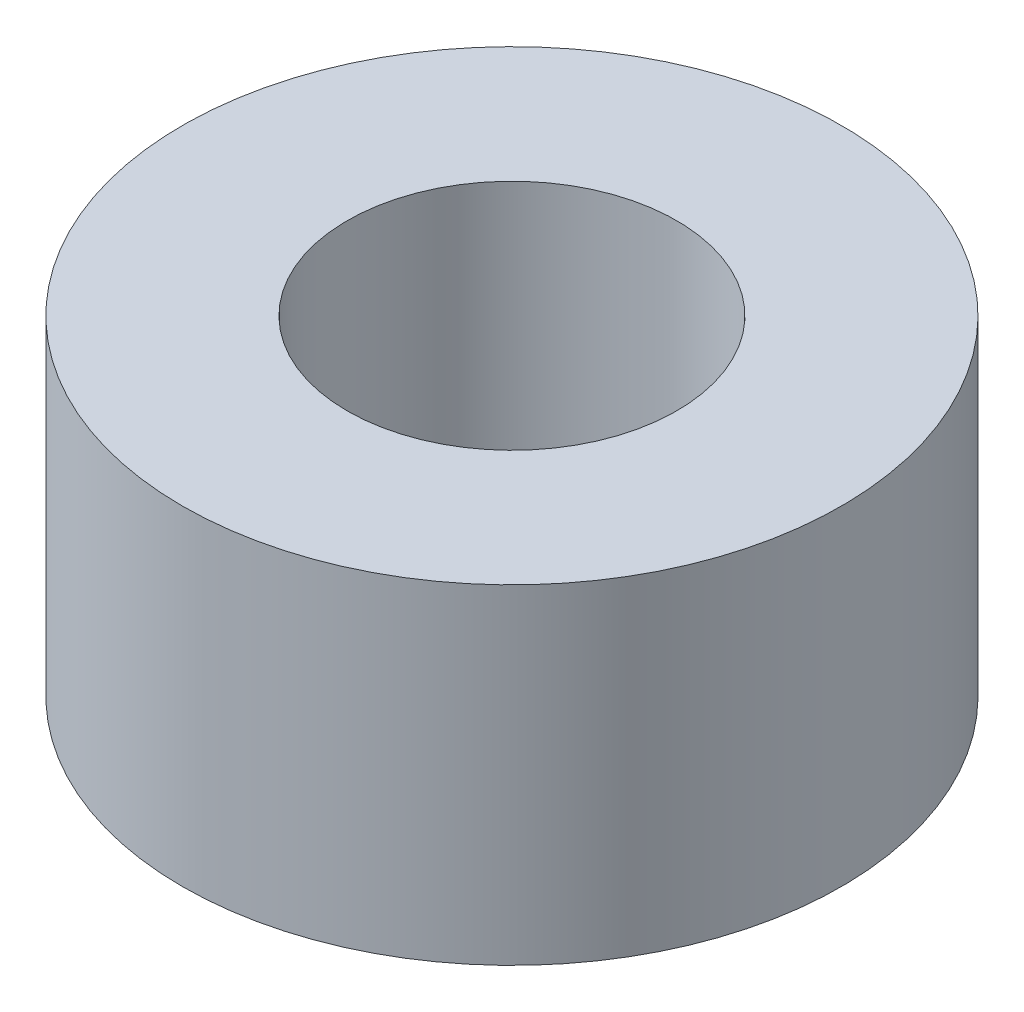
ISO-10303-21;
HEADER;
FILE_DESCRIPTION(('STEP AP214'),'2;1');
FILE_NAME('part.step','',(''),(''),'','','');
FILE_SCHEMA(('AUTOMOTIVE_DESIGN { 1 0 10303 214 1 1 1 1 }'));
ENDSEC;
DATA;
#1=APPLICATION_CONTEXT('core data for automotive mechanical design processes');
#2=APPLICATION_PROTOCOL_DEFINITION('international standard','automotive_design',2000,#1);
#3=PRODUCT_CONTEXT('',#1,'mechanical');
#4=PRODUCT('Part','Part','',(#3));
#5=PRODUCT_RELATED_PRODUCT_CATEGORY('part','',(#4));
#6=PRODUCT_DEFINITION_FORMATION('','',#4);
#7=PRODUCT_DEFINITION_CONTEXT('part definition',#1,'design');
#8=PRODUCT_DEFINITION('design','',#6,#7);
#9=PRODUCT_DEFINITION_SHAPE('','',#8);
#10=(LENGTH_UNIT() NAMED_UNIT(*) SI_UNIT(.MILLI.,.METRE.));
#11=(NAMED_UNIT(*) PLANE_ANGLE_UNIT() SI_UNIT($,.RADIAN.));
#12=(NAMED_UNIT(*) SI_UNIT($,.STERADIAN.) SOLID_ANGLE_UNIT());
#13=UNCERTAINTY_MEASURE_WITH_UNIT(LENGTH_MEASURE(1.E-05),#10,'distance_accuracy_value','');
#14=(GEOMETRIC_REPRESENTATION_CONTEXT(3) GLOBAL_UNCERTAINTY_ASSIGNED_CONTEXT((#13)) GLOBAL_UNIT_ASSIGNED_CONTEXT((#10,
#11,#12)) REPRESENTATION_CONTEXT('',''));
#15=CARTESIAN_POINT('',(0.,0.,0.));
#16=DIRECTION('',(0.,0.,1.));
#17=DIRECTION('',(1.,0.,0.));
#18=AXIS2_PLACEMENT_3D('',#15,#16,#17);
#19=CARTESIAN_POINT('',(0.,5.08,0.));
#20=DIRECTION('',(0.,1.,0.));
#21=DIRECTION('',(0.,0.,1.));
#22=AXIS2_PLACEMENT_3D('',#19,#20,#21);
#23=PLANE('',#22);
#24=CARTESIAN_POINT('',(0.,5.08,0.));
#25=DIRECTION('',(0.,1.,0.));
#26=DIRECTION('',(0.,0.,1.));
#27=AXIS2_PLACEMENT_3D('',#24,#25,#26);
#28=CIRCLE('',#27,5.08);
#29=CARTESIAN_POINT('',(0.,5.08,5.08));
#30=VERTEX_POINT('',#29);
#31=EDGE_CURVE('E10',#30,#30,#28,.T.);
#32=ORIENTED_EDGE('',*,*,#31,.T.);
#33=EDGE_LOOP('',(#32));
#34=FACE_BOUND('',#33,.T.);
#35=CARTESIAN_POINT('',(0.,5.08,0.));
#36=DIRECTION('',(0.,1.,0.));
#37=DIRECTION('',(0.,0.,1.));
#38=AXIS2_PLACEMENT_3D('',#35,#36,#37);
#39=CIRCLE('',#38,2.54);
#40=CARTESIAN_POINT('',(0.,5.08,2.54));
#41=VERTEX_POINT('',#40);
#42=EDGE_CURVE('E42',#41,#41,#39,.T.);
#43=ORIENTED_EDGE('',*,*,#42,.F.);
#44=EDGE_LOOP('',(#43));
#45=FACE_BOUND('',#44,.T.);
#46=ADVANCED_FACE('F31',(#34,#45),#23,.T.);
#47=CARTESIAN_POINT('',(0.,0.,0.));
#48=DIRECTION('',(0.,1.,0.));
#49=DIRECTION('',(0.,0.,1.));
#50=AXIS2_PLACEMENT_3D('',#47,#48,#49);
#51=PLANE('',#50);
#52=CARTESIAN_POINT('',(0.,0.,0.));
#53=DIRECTION('',(0.,1.,0.));
#54=DIRECTION('',(0.,0.,1.));
#55=AXIS2_PLACEMENT_3D('',#52,#53,#54);
#56=CIRCLE('',#55,5.08);
#57=CARTESIAN_POINT('',(0.,0.,5.08));
#58=VERTEX_POINT('',#57);
#59=EDGE_CURVE('E35',#58,#58,#56,.T.);
#60=ORIENTED_EDGE('',*,*,#59,.F.);
#61=EDGE_LOOP('',(#60));
#62=FACE_BOUND('',#61,.T.);
#63=CARTESIAN_POINT('',(0.,0.,0.));
#64=DIRECTION('',(0.,1.,0.));
#65=DIRECTION('',(0.,0.,1.));
#66=AXIS2_PLACEMENT_3D('',#63,#64,#65);
#67=CIRCLE('',#66,2.54);
#68=CARTESIAN_POINT('',(0.,0.,2.54));
#69=VERTEX_POINT('',#68);
#70=EDGE_CURVE('E44',#69,#69,#67,.T.);
#71=ORIENTED_EDGE('',*,*,#70,.T.);
#72=EDGE_LOOP('',(#71));
#73=FACE_BOUND('',#72,.T.);
#74=ADVANCED_FACE('F54',(#62,#73),#51,.F.);
#75=CARTESIAN_POINT('',(0.,5.08,0.));
#76=DIRECTION('',(0.,-1.,0.));
#77=DIRECTION('',(0.,0.,-1.));
#78=AXIS2_PLACEMENT_3D('',#75,#76,#77);
#79=CYLINDRICAL_SURFACE('',#78,5.08);
#80=ORIENTED_EDGE('',*,*,#31,.F.);
#81=EDGE_LOOP('',(#80));
#82=FACE_BOUND('',#81,.T.);
#83=ORIENTED_EDGE('',*,*,#59,.T.);
#84=EDGE_LOOP('',(#83));
#85=FACE_BOUND('',#84,.T.);
#86=ADVANCED_FACE('F33',(#82,#85),#79,.T.);
#87=CARTESIAN_POINT('',(0.,5.08,0.));
#88=DIRECTION('',(0.,-1.,0.));
#89=DIRECTION('',(0.,0.,-1.));
#90=AXIS2_PLACEMENT_3D('',#87,#88,#89);
#91=CYLINDRICAL_SURFACE('',#90,2.54);
#92=ORIENTED_EDGE('',*,*,#42,.T.);
#93=EDGE_LOOP('',(#92));
#94=FACE_BOUND('',#93,.T.);
#95=ORIENTED_EDGE('',*,*,#70,.F.);
#96=EDGE_LOOP('',(#95));
#97=FACE_BOUND('',#96,.T.);
#98=ADVANCED_FACE('F50',(#94,#97),#91,.F.);
#99=CLOSED_SHELL('',(#46,#74,#86,#98));
#100=MANIFOLD_SOLID_BREP('B2',#99);
#101=ADVANCED_BREP_SHAPE_REPRESENTATION('',(#18,#100),#14);
#102=SHAPE_DEFINITION_REPRESENTATION(#9,#101);
ENDSEC;
END-ISO-10303-21;
